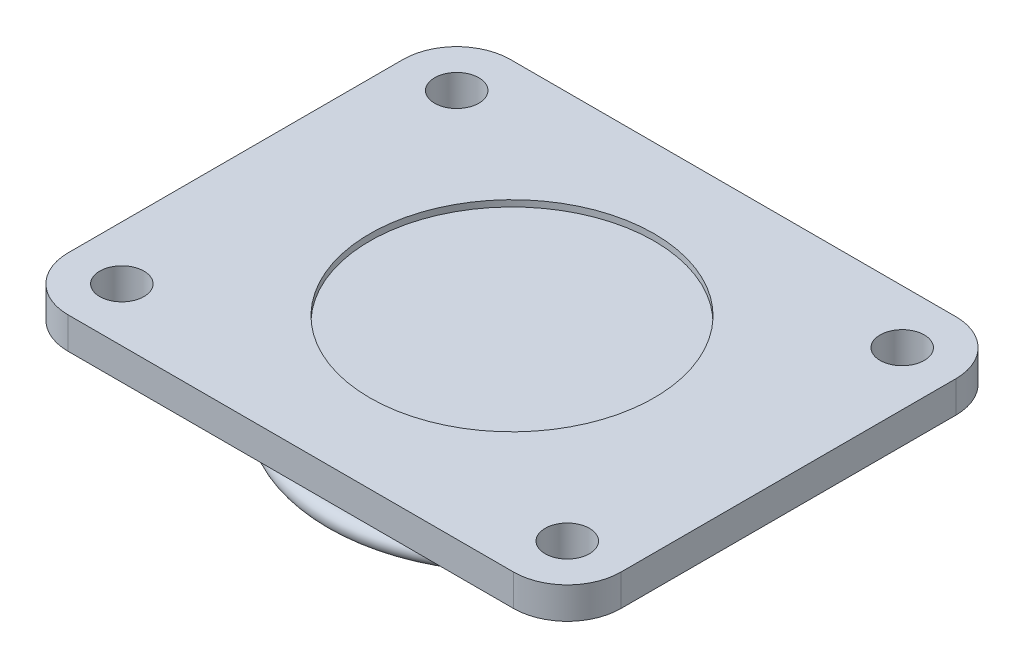
ISO-10303-21;
HEADER;
FILE_DESCRIPTION(('STEP AP214'),'2;1');
FILE_NAME('part.step','',(''),(''),'','','');
FILE_SCHEMA(('AUTOMOTIVE_DESIGN { 1 0 10303 214 1 1 1 1 }'));
ENDSEC;
DATA;
#1=APPLICATION_CONTEXT('core data for automotive mechanical design processes');
#2=APPLICATION_PROTOCOL_DEFINITION('international standard','automotive_design',2000,#1);
#3=PRODUCT_CONTEXT('',#1,'mechanical');
#4=PRODUCT('Part','Part','',(#3));
#5=PRODUCT_RELATED_PRODUCT_CATEGORY('part','',(#4));
#6=PRODUCT_DEFINITION_FORMATION('','',#4);
#7=PRODUCT_DEFINITION_CONTEXT('part definition',#1,'design');
#8=PRODUCT_DEFINITION('design','',#6,#7);
#9=PRODUCT_DEFINITION_SHAPE('','',#8);
#10=(LENGTH_UNIT() NAMED_UNIT(*) SI_UNIT(.MILLI.,.METRE.));
#11=(NAMED_UNIT(*) PLANE_ANGLE_UNIT() SI_UNIT($,.RADIAN.));
#12=(NAMED_UNIT(*) SI_UNIT($,.STERADIAN.) SOLID_ANGLE_UNIT());
#13=UNCERTAINTY_MEASURE_WITH_UNIT(LENGTH_MEASURE(1.E-05),#10,'distance_accuracy_value','');
#14=(GEOMETRIC_REPRESENTATION_CONTEXT(3) GLOBAL_UNCERTAINTY_ASSIGNED_CONTEXT((#13)) GLOBAL_UNIT_ASSIGNED_CONTEXT((#10,
#11,#12)) REPRESENTATION_CONTEXT('',''));
#15=CARTESIAN_POINT('',(0.,0.,0.));
#16=DIRECTION('',(0.,0.,1.));
#17=DIRECTION('',(1.,0.,0.));
#18=AXIS2_PLACEMENT_3D('',#15,#16,#17);
#19=CARTESIAN_POINT('',(70.5,10.,-53.));
#20=DIRECTION('',(0.,-1.,0.));
#21=DIRECTION('',(0.,0.,-1.));
#22=AXIS2_PLACEMENT_3D('',#19,#20,#21);
#23=PLANE('',#22);
#24=CARTESIAN_POINT('',(0.,10.,0.));
#25=DIRECTION('',(0.,1.,0.));
#26=DIRECTION('',(0.,0.,1.));
#27=AXIS2_PLACEMENT_3D('',#24,#25,#26);
#28=CIRCLE('',#27,45.);
#29=CARTESIAN_POINT('',(0.,10.,45.));
#30=VERTEX_POINT('',#29);
#31=EDGE_CURVE('E286',#30,#30,#28,.T.);
#32=ORIENTED_EDGE('',*,*,#31,.F.);
#33=EDGE_LOOP('',(#32));
#34=FACE_BOUND('',#33,.T.);
#35=CARTESIAN_POINT('',(70.5,10.,-53.));
#36=DIRECTION('',(0.,1.,0.));
#37=DIRECTION('',(0.,0.,-1.));
#38=AXIS2_PLACEMENT_3D('',#35,#36,#37);
#39=CIRCLE('',#38,17.);
#40=CARTESIAN_POINT('',(87.5,10.,-52.9999999999999));
#41=VERTEX_POINT('',#40);
#42=CARTESIAN_POINT('',(70.4999999999999,10.,-70.));
#43=VERTEX_POINT('',#42);
#44=EDGE_CURVE('E148',#41,#43,#39,.T.);
#45=ORIENTED_EDGE('',*,*,#44,.T.);
#46=DIRECTION('',(-1.,0.,0.));
#47=VECTOR('',#46,1.);
#48=CARTESIAN_POINT('',(-70.4999999999998,10.,-70.));
#49=LINE('',#48,#47);
#50=CARTESIAN_POINT('',(-70.4999999999998,10.,-70.));
#51=VERTEX_POINT('',#50);
#52=EDGE_CURVE('E96',#43,#51,#49,.T.);
#53=ORIENTED_EDGE('',*,*,#52,.T.);
#54=CARTESIAN_POINT('',(-70.5,10.,-53.));
#55=DIRECTION('',(0.,1.,0.));
#56=DIRECTION('',(0.,0.,1.));
#57=AXIS2_PLACEMENT_3D('',#54,#55,#56);
#58=CIRCLE('',#57,17.);
#59=CARTESIAN_POINT('',(-87.5,10.,-52.9999999999999));
#60=VERTEX_POINT('',#59);
#61=EDGE_CURVE('E199',#51,#60,#58,.T.);
#62=ORIENTED_EDGE('',*,*,#61,.T.);
#63=DIRECTION('',(0.,0.,1.));
#64=VECTOR('',#63,1.);
#65=CARTESIAN_POINT('',(-87.5,10.,-52.9999999999999));
#66=LINE('',#65,#64);
#67=CARTESIAN_POINT('',(-87.5,10.,52.9999999999999));
#68=VERTEX_POINT('',#67);
#69=EDGE_CURVE('E201',#60,#68,#66,.T.);
#70=ORIENTED_EDGE('',*,*,#69,.T.);
#71=CARTESIAN_POINT('',(-70.5,10.,53.));
#72=DIRECTION('',(0.,1.,0.));
#73=DIRECTION('',(0.,0.,1.));
#74=AXIS2_PLACEMENT_3D('',#71,#72,#73);
#75=CIRCLE('',#74,17.);
#76=CARTESIAN_POINT('',(-70.5,10.,70.));
#77=VERTEX_POINT('',#76);
#78=EDGE_CURVE('E115',#68,#77,#75,.T.);
#79=ORIENTED_EDGE('',*,*,#78,.T.);
#80=DIRECTION('',(1.,0.,0.));
#81=VECTOR('',#80,1.);
#82=CARTESIAN_POINT('',(-70.4999999999998,10.,70.));
#83=LINE('',#82,#81);
#84=CARTESIAN_POINT('',(70.4999999999999,10.,70.));
#85=VERTEX_POINT('',#84);
#86=EDGE_CURVE('E109',#77,#85,#83,.T.);
#87=ORIENTED_EDGE('',*,*,#86,.T.);
#88=CARTESIAN_POINT('',(70.5,10.,53.));
#89=DIRECTION('',(0.,1.,0.));
#90=DIRECTION('',(0.,0.,1.));
#91=AXIS2_PLACEMENT_3D('',#88,#89,#90);
#92=CIRCLE('',#91,17.);
#93=CARTESIAN_POINT('',(87.5,10.,52.9999999999999));
#94=VERTEX_POINT('',#93);
#95=EDGE_CURVE('E113',#85,#94,#92,.T.);
#96=ORIENTED_EDGE('',*,*,#95,.T.);
#97=DIRECTION('',(0.,0.,-1.));
#98=VECTOR('',#97,1.);
#99=CARTESIAN_POINT('',(87.5,10.,-52.9999999999999));
#100=LINE('',#99,#98);
#101=EDGE_CURVE('E52',#94,#41,#100,.T.);
#102=ORIENTED_EDGE('',*,*,#101,.T.);
#103=EDGE_LOOP('',(#45,#53,#62,#70,#79,#87,#96,#102));
#104=FACE_BOUND('',#103,.T.);
#105=CARTESIAN_POINT('',(-70.5,10.,-53.));
#106=DIRECTION('',(0.,1.,0.));
#107=DIRECTION('',(0.,0.,1.));
#108=AXIS2_PLACEMENT_3D('',#105,#106,#107);
#109=CIRCLE('',#108,7.);
#110=CARTESIAN_POINT('',(-70.5,10.,-46.));
#111=VERTEX_POINT('',#110);
#112=EDGE_CURVE('E137',#111,#111,#109,.T.);
#113=ORIENTED_EDGE('',*,*,#112,.F.);
#114=EDGE_LOOP('',(#113));
#115=FACE_BOUND('',#114,.T.);
#116=CARTESIAN_POINT('',(70.5,10.,-53.));
#117=DIRECTION('',(0.,1.,0.));
#118=DIRECTION('',(0.,0.,1.));
#119=AXIS2_PLACEMENT_3D('',#116,#117,#118);
#120=CIRCLE('',#119,7.);
#121=CARTESIAN_POINT('',(70.5,10.,-46.));
#122=VERTEX_POINT('',#121);
#123=EDGE_CURVE('E187',#122,#122,#120,.T.);
#124=ORIENTED_EDGE('',*,*,#123,.F.);
#125=EDGE_LOOP('',(#124));
#126=FACE_BOUND('',#125,.T.);
#127=CARTESIAN_POINT('',(70.5,10.,53.));
#128=DIRECTION('',(0.,1.,0.));
#129=DIRECTION('',(0.,0.,1.));
#130=AXIS2_PLACEMENT_3D('',#127,#128,#129);
#131=CIRCLE('',#130,7.);
#132=CARTESIAN_POINT('',(70.5,10.,60.));
#133=VERTEX_POINT('',#132);
#134=EDGE_CURVE('E181',#133,#133,#131,.T.);
#135=ORIENTED_EDGE('',*,*,#134,.F.);
#136=EDGE_LOOP('',(#135));
#137=FACE_BOUND('',#136,.T.);
#138=CARTESIAN_POINT('',(-70.5,10.,53.));
#139=DIRECTION('',(0.,1.,0.));
#140=DIRECTION('',(0.,0.,1.));
#141=AXIS2_PLACEMENT_3D('',#138,#139,#140);
#142=CIRCLE('',#141,7.);
#143=CARTESIAN_POINT('',(-70.5,10.,60.));
#144=VERTEX_POINT('',#143);
#145=EDGE_CURVE('E174',#144,#144,#142,.T.);
#146=ORIENTED_EDGE('',*,*,#145,.F.);
#147=EDGE_LOOP('',(#146));
#148=FACE_BOUND('',#147,.T.);
#149=ADVANCED_FACE('F35',(#34,#104,#115,#126,#137,#148),#23,.F.);
#150=CARTESIAN_POINT('',(70.5,0.,-53.));
#151=DIRECTION('',(0.,-1.,0.));
#152=DIRECTION('',(0.,0.,-1.));
#153=AXIS2_PLACEMENT_3D('',#150,#151,#152);
#154=PLANE('',#153);
#155=CARTESIAN_POINT('',(0.,0.,0.));
#156=DIRECTION('',(0.,-1.,0.));
#157=DIRECTION('',(0.,0.,-1.));
#158=AXIS2_PLACEMENT_3D('',#155,#156,#157);
#159=CIRCLE('',#158,56.);
#160=CARTESIAN_POINT('',(0.,0.,-56.));
#161=VERTEX_POINT('',#160);
#162=EDGE_CURVE('E162',#161,#161,#159,.T.);
#163=ORIENTED_EDGE('',*,*,#162,.F.);
#164=EDGE_LOOP('',(#163));
#165=FACE_BOUND('',#164,.T.);
#166=CARTESIAN_POINT('',(70.5,0.,53.));
#167=DIRECTION('',(0.,1.,0.));
#168=DIRECTION('',(0.,0.,1.));
#169=AXIS2_PLACEMENT_3D('',#166,#167,#168);
#170=CIRCLE('',#169,7.);
#171=CARTESIAN_POINT('',(70.5,0.,60.));
#172=VERTEX_POINT('',#171);
#173=EDGE_CURVE('E177',#172,#172,#170,.T.);
#174=ORIENTED_EDGE('',*,*,#173,.T.);
#175=EDGE_LOOP('',(#174));
#176=FACE_BOUND('',#175,.T.);
#177=CARTESIAN_POINT('',(-70.5,0.,-53.));
#178=DIRECTION('',(0.,1.,0.));
#179=DIRECTION('',(0.,0.,1.));
#180=AXIS2_PLACEMENT_3D('',#177,#178,#179);
#181=CIRCLE('',#180,7.);
#182=CARTESIAN_POINT('',(-70.5,0.,-46.));
#183=VERTEX_POINT('',#182);
#184=EDGE_CURVE('E190',#183,#183,#181,.T.);
#185=ORIENTED_EDGE('',*,*,#184,.T.);
#186=EDGE_LOOP('',(#185));
#187=FACE_BOUND('',#186,.T.);
#188=CARTESIAN_POINT('',(70.5,0.,-53.));
#189=DIRECTION('',(0.,1.,0.));
#190=DIRECTION('',(0.,0.,-1.));
#191=AXIS2_PLACEMENT_3D('',#188,#189,#190);
#192=CIRCLE('',#191,17.);
#193=CARTESIAN_POINT('',(87.5,0.,-52.9999999999999));
#194=VERTEX_POINT('',#193);
#195=CARTESIAN_POINT('',(70.4999999999999,0.,-70.));
#196=VERTEX_POINT('',#195);
#197=EDGE_CURVE('E133',#194,#196,#192,.T.);
#198=ORIENTED_EDGE('',*,*,#197,.F.);
#199=DIRECTION('',(0.,0.,-1.));
#200=VECTOR('',#199,1.);
#201=CARTESIAN_POINT('',(87.5,0.,-52.9999999999999));
#202=LINE('',#201,#200);
#203=CARTESIAN_POINT('',(87.5,0.,52.9999999999999));
#204=VERTEX_POINT('',#203);
#205=EDGE_CURVE('E87',#204,#194,#202,.T.);
#206=ORIENTED_EDGE('',*,*,#205,.F.);
#207=CARTESIAN_POINT('',(70.5,0.,53.));
#208=DIRECTION('',(0.,1.,0.));
#209=DIRECTION('',(0.,0.,1.));
#210=AXIS2_PLACEMENT_3D('',#207,#208,#209);
#211=CIRCLE('',#210,17.);
#212=CARTESIAN_POINT('',(70.4999999999999,0.,70.));
#213=VERTEX_POINT('',#212);
#214=EDGE_CURVE('E81',#213,#204,#211,.T.);
#215=ORIENTED_EDGE('',*,*,#214,.F.);
#216=DIRECTION('',(1.,0.,0.));
#217=VECTOR('',#216,1.);
#218=CARTESIAN_POINT('',(-70.4999999999998,0.,70.));
#219=LINE('',#218,#217);
#220=CARTESIAN_POINT('',(-70.5,0.,70.));
#221=VERTEX_POINT('',#220);
#222=EDGE_CURVE('E123',#221,#213,#219,.T.);
#223=ORIENTED_EDGE('',*,*,#222,.F.);
#224=CARTESIAN_POINT('',(-70.5,0.,53.));
#225=DIRECTION('',(0.,1.,0.));
#226=DIRECTION('',(0.,0.,1.));
#227=AXIS2_PLACEMENT_3D('',#224,#225,#226);
#228=CIRCLE('',#227,17.);
#229=CARTESIAN_POINT('',(-87.5,0.,52.9999999999999));
#230=VERTEX_POINT('',#229);
#231=EDGE_CURVE('E143',#230,#221,#228,.T.);
#232=ORIENTED_EDGE('',*,*,#231,.F.);
#233=DIRECTION('',(0.,0.,1.));
#234=VECTOR('',#233,1.);
#235=CARTESIAN_POINT('',(-87.5,0.,-52.9999999999999));
#236=LINE('',#235,#234);
#237=CARTESIAN_POINT('',(-87.5,0.,-52.9999999999999));
#238=VERTEX_POINT('',#237);
#239=EDGE_CURVE('E141',#238,#230,#236,.T.);
#240=ORIENTED_EDGE('',*,*,#239,.F.);
#241=CARTESIAN_POINT('',(-70.5,0.,-53.));
#242=DIRECTION('',(0.,1.,0.));
#243=DIRECTION('',(0.,0.,1.));
#244=AXIS2_PLACEMENT_3D('',#241,#242,#243);
#245=CIRCLE('',#244,17.);
#246=CARTESIAN_POINT('',(-70.4999999999998,0.,-70.));
#247=VERTEX_POINT('',#246);
#248=EDGE_CURVE('E139',#247,#238,#245,.T.);
#249=ORIENTED_EDGE('',*,*,#248,.F.);
#250=DIRECTION('',(-1.,0.,0.));
#251=VECTOR('',#250,1.);
#252=CARTESIAN_POINT('',(-70.4999999999998,0.,-70.));
#253=LINE('',#252,#251);
#254=EDGE_CURVE('E136',#196,#247,#253,.T.);
#255=ORIENTED_EDGE('',*,*,#254,.F.);
#256=EDGE_LOOP('',(#198,#206,#215,#223,#232,#240,#249,#255));
#257=FACE_BOUND('',#256,.T.);
#258=CARTESIAN_POINT('',(70.5,0.,-53.));
#259=DIRECTION('',(0.,1.,0.));
#260=DIRECTION('',(0.,0.,1.));
#261=AXIS2_PLACEMENT_3D('',#258,#259,#260);
#262=CIRCLE('',#261,7.);
#263=CARTESIAN_POINT('',(70.5,0.,-46.));
#264=VERTEX_POINT('',#263);
#265=EDGE_CURVE('E184',#264,#264,#262,.T.);
#266=ORIENTED_EDGE('',*,*,#265,.T.);
#267=EDGE_LOOP('',(#266));
#268=FACE_BOUND('',#267,.T.);
#269=CARTESIAN_POINT('',(-70.5,0.,53.));
#270=DIRECTION('',(0.,1.,0.));
#271=DIRECTION('',(0.,0.,1.));
#272=AXIS2_PLACEMENT_3D('',#269,#270,#271);
#273=CIRCLE('',#272,7.);
#274=CARTESIAN_POINT('',(-70.5,0.,60.));
#275=VERTEX_POINT('',#274);
#276=EDGE_CURVE('E178',#275,#275,#273,.T.);
#277=ORIENTED_EDGE('',*,*,#276,.T.);
#278=EDGE_LOOP('',(#277));
#279=FACE_BOUND('',#278,.T.);
#280=ADVANCED_FACE('F214',(#165,#176,#187,#257,#268,#279),#154,.T.);
#281=CARTESIAN_POINT('',(70.5,10.,-53.));
#282=DIRECTION('',(0.,-1.,0.));
#283=DIRECTION('',(0.,0.,-1.));
#284=AXIS2_PLACEMENT_3D('',#281,#282,#283);
#285=CYLINDRICAL_SURFACE('',#284,17.);
#286=ORIENTED_EDGE('',*,*,#197,.T.);
#287=DIRECTION('',(0.,-1.,0.));
#288=VECTOR('',#287,1.);
#289=CARTESIAN_POINT('',(70.4999999999999,10.,-70.));
#290=LINE('',#289,#288);
#291=EDGE_CURVE('E161',#43,#196,#290,.T.);
#292=ORIENTED_EDGE('',*,*,#291,.F.);
#293=ORIENTED_EDGE('',*,*,#44,.F.);
#294=DIRECTION('',(0.,-1.,0.));
#295=VECTOR('',#294,1.);
#296=CARTESIAN_POINT('',(87.5,10.,-52.9999999999999));
#297=LINE('',#296,#295);
#298=EDGE_CURVE('E129',#41,#194,#297,.T.);
#299=ORIENTED_EDGE('',*,*,#298,.T.);
#300=EDGE_LOOP('',(#286,#292,#293,#299));
#301=FACE_BOUND('',#300,.T.);
#302=ADVANCED_FACE('F219',(#301),#285,.T.);
#303=CARTESIAN_POINT('',(-70.4999999999998,10.,-70.));
#304=DIRECTION('',(0.,0.,1.));
#305=DIRECTION('',(1.,0.,0.));
#306=AXIS2_PLACEMENT_3D('',#303,#304,#305);
#307=PLANE('',#306);
#308=ORIENTED_EDGE('',*,*,#254,.T.);
#309=DIRECTION('',(0.,-1.,0.));
#310=VECTOR('',#309,1.);
#311=CARTESIAN_POINT('',(-70.4999999999998,10.,-70.));
#312=LINE('',#311,#310);
#313=EDGE_CURVE('E158',#51,#247,#312,.T.);
#314=ORIENTED_EDGE('',*,*,#313,.F.);
#315=ORIENTED_EDGE('',*,*,#52,.F.);
#316=ORIENTED_EDGE('',*,*,#291,.T.);
#317=EDGE_LOOP('',(#308,#314,#315,#316));
#318=FACE_BOUND('',#317,.T.);
#319=ADVANCED_FACE('F393',(#318),#307,.F.);
#320=CARTESIAN_POINT('',(-70.5,10.,-53.));
#321=DIRECTION('',(0.,-1.,0.));
#322=DIRECTION('',(0.,0.,-1.));
#323=AXIS2_PLACEMENT_3D('',#320,#321,#322);
#324=CYLINDRICAL_SURFACE('',#323,17.);
#325=ORIENTED_EDGE('',*,*,#248,.T.);
#326=DIRECTION('',(0.,-1.,0.));
#327=VECTOR('',#326,1.);
#328=CARTESIAN_POINT('',(-87.5,10.,-52.9999999999999));
#329=LINE('',#328,#327);
#330=EDGE_CURVE('E155',#60,#238,#329,.T.);
#331=ORIENTED_EDGE('',*,*,#330,.F.);
#332=ORIENTED_EDGE('',*,*,#61,.F.);
#333=ORIENTED_EDGE('',*,*,#313,.T.);
#334=EDGE_LOOP('',(#325,#331,#332,#333));
#335=FACE_BOUND('',#334,.T.);
#336=ADVANCED_FACE('F384',(#335),#324,.T.);
#337=CARTESIAN_POINT('',(-87.5,10.,-52.9999999999999));
#338=DIRECTION('',(1.,0.,0.));
#339=DIRECTION('',(0.,0.,-1.));
#340=AXIS2_PLACEMENT_3D('',#337,#338,#339);
#341=PLANE('',#340);
#342=ORIENTED_EDGE('',*,*,#239,.T.);
#343=DIRECTION('',(0.,-1.,0.));
#344=VECTOR('',#343,1.);
#345=CARTESIAN_POINT('',(-87.5,10.,52.9999999999999));
#346=LINE('',#345,#344);
#347=EDGE_CURVE('E152',#68,#230,#346,.T.);
#348=ORIENTED_EDGE('',*,*,#347,.F.);
#349=ORIENTED_EDGE('',*,*,#69,.F.);
#350=ORIENTED_EDGE('',*,*,#330,.T.);
#351=EDGE_LOOP('',(#342,#348,#349,#350));
#352=FACE_BOUND('',#351,.T.);
#353=ADVANCED_FACE('F207',(#352),#341,.F.);
#354=CARTESIAN_POINT('',(-70.5,10.,53.));
#355=DIRECTION('',(0.,-1.,0.));
#356=DIRECTION('',(0.,0.,-1.));
#357=AXIS2_PLACEMENT_3D('',#354,#355,#356);
#358=CYLINDRICAL_SURFACE('',#357,17.);
#359=ORIENTED_EDGE('',*,*,#231,.T.);
#360=DIRECTION('',(0.,-1.,0.));
#361=VECTOR('',#360,1.);
#362=CARTESIAN_POINT('',(-70.5,10.,70.));
#363=LINE('',#362,#361);
#364=EDGE_CURVE('E124',#77,#221,#363,.T.);
#365=ORIENTED_EDGE('',*,*,#364,.F.);
#366=ORIENTED_EDGE('',*,*,#78,.F.);
#367=ORIENTED_EDGE('',*,*,#347,.T.);
#368=EDGE_LOOP('',(#359,#365,#366,#367));
#369=FACE_BOUND('',#368,.T.);
#370=ADVANCED_FACE('F211',(#369),#358,.T.);
#371=CARTESIAN_POINT('',(-70.4999999999998,10.,70.));
#372=DIRECTION('',(0.,0.,-1.));
#373=DIRECTION('',(-1.,0.,0.));
#374=AXIS2_PLACEMENT_3D('',#371,#372,#373);
#375=PLANE('',#374);
#376=ORIENTED_EDGE('',*,*,#222,.T.);
#377=DIRECTION('',(0.,-1.,0.));
#378=VECTOR('',#377,1.);
#379=CARTESIAN_POINT('',(70.4999999999999,10.,70.));
#380=LINE('',#379,#378);
#381=EDGE_CURVE('E120',#85,#213,#380,.T.);
#382=ORIENTED_EDGE('',*,*,#381,.F.);
#383=ORIENTED_EDGE('',*,*,#86,.F.);
#384=ORIENTED_EDGE('',*,*,#364,.T.);
#385=EDGE_LOOP('',(#376,#382,#383,#384));
#386=FACE_BOUND('',#385,.T.);
#387=ADVANCED_FACE('F121',(#386),#375,.F.);
#388=CARTESIAN_POINT('',(70.5,10.,53.));
#389=DIRECTION('',(0.,-1.,0.));
#390=DIRECTION('',(0.,0.,-1.));
#391=AXIS2_PLACEMENT_3D('',#388,#389,#390);
#392=CYLINDRICAL_SURFACE('',#391,17.);
#393=ORIENTED_EDGE('',*,*,#214,.T.);
#394=DIRECTION('',(0.,-1.,0.));
#395=VECTOR('',#394,1.);
#396=CARTESIAN_POINT('',(87.5,10.,52.9999999999999));
#397=LINE('',#396,#395);
#398=EDGE_CURVE('E125',#94,#204,#397,.T.);
#399=ORIENTED_EDGE('',*,*,#398,.F.);
#400=ORIENTED_EDGE('',*,*,#95,.F.);
#401=ORIENTED_EDGE('',*,*,#381,.T.);
#402=EDGE_LOOP('',(#393,#399,#400,#401));
#403=FACE_BOUND('',#402,.T.);
#404=ADVANCED_FACE('F127',(#403),#392,.T.);
#405=CARTESIAN_POINT('',(87.5,10.,-52.9999999999999));
#406=DIRECTION('',(-1.,0.,0.));
#407=DIRECTION('',(0.,0.,1.));
#408=AXIS2_PLACEMENT_3D('',#405,#406,#407);
#409=PLANE('',#408);
#410=ORIENTED_EDGE('',*,*,#205,.T.);
#411=ORIENTED_EDGE('',*,*,#298,.F.);
#412=ORIENTED_EDGE('',*,*,#101,.F.);
#413=ORIENTED_EDGE('',*,*,#398,.T.);
#414=EDGE_LOOP('',(#410,#411,#412,#413));
#415=FACE_BOUND('',#414,.T.);
#416=ADVANCED_FACE('F221',(#415),#409,.F.);
#417=CARTESIAN_POINT('',(-70.5,10.,-53.));
#418=DIRECTION('',(0.,-1.,0.));
#419=DIRECTION('',(0.,0.,-1.));
#420=AXIS2_PLACEMENT_3D('',#417,#418,#419);
#421=CYLINDRICAL_SURFACE('',#420,7.);
#422=ORIENTED_EDGE('',*,*,#112,.T.);
#423=EDGE_LOOP('',(#422));
#424=FACE_BOUND('',#423,.T.);
#425=ORIENTED_EDGE('',*,*,#184,.F.);
#426=EDGE_LOOP('',(#425));
#427=FACE_BOUND('',#426,.T.);
#428=ADVANCED_FACE('F223',(#424,#427),#421,.F.);
#429=CARTESIAN_POINT('',(70.5,10.,-53.));
#430=DIRECTION('',(0.,-1.,0.));
#431=DIRECTION('',(0.,0.,-1.));
#432=AXIS2_PLACEMENT_3D('',#429,#430,#431);
#433=CYLINDRICAL_SURFACE('',#432,7.);
#434=ORIENTED_EDGE('',*,*,#123,.T.);
#435=EDGE_LOOP('',(#434));
#436=FACE_BOUND('',#435,.T.);
#437=ORIENTED_EDGE('',*,*,#265,.F.);
#438=EDGE_LOOP('',(#437));
#439=FACE_BOUND('',#438,.T.);
#440=ADVANCED_FACE('F229',(#436,#439),#433,.F.);
#441=CARTESIAN_POINT('',(70.5,10.,53.));
#442=DIRECTION('',(0.,-1.,0.));
#443=DIRECTION('',(0.,0.,-1.));
#444=AXIS2_PLACEMENT_3D('',#441,#442,#443);
#445=CYLINDRICAL_SURFACE('',#444,7.);
#446=ORIENTED_EDGE('',*,*,#134,.T.);
#447=EDGE_LOOP('',(#446));
#448=FACE_BOUND('',#447,.T.);
#449=ORIENTED_EDGE('',*,*,#173,.F.);
#450=EDGE_LOOP('',(#449));
#451=FACE_BOUND('',#450,.T.);
#452=ADVANCED_FACE('F245',(#448,#451),#445,.F.);
#453=CARTESIAN_POINT('',(-70.5,10.,53.));
#454=DIRECTION('',(0.,-1.,0.));
#455=DIRECTION('',(0.,0.,-1.));
#456=AXIS2_PLACEMENT_3D('',#453,#454,#455);
#457=CYLINDRICAL_SURFACE('',#456,7.);
#458=ORIENTED_EDGE('',*,*,#145,.T.);
#459=EDGE_LOOP('',(#458));
#460=FACE_BOUND('',#459,.T.);
#461=ORIENTED_EDGE('',*,*,#276,.F.);
#462=EDGE_LOOP('',(#461));
#463=FACE_BOUND('',#462,.T.);
#464=ADVANCED_FACE('F249',(#460,#463),#457,.F.);
#465=CARTESIAN_POINT('',(0.,-20.,0.));
#466=DIRECTION('',(0.,1.,0.));
#467=DIRECTION('',(0.,0.,1.));
#468=AXIS2_PLACEMENT_3D('',#465,#466,#467);
#469=CYLINDRICAL_SURFACE('',#468,56.);
#470=CARTESIAN_POINT('',(0.,-14.,0.));
#471=DIRECTION('',(0.,-1.,0.));
#472=DIRECTION('',(0.,0.,-1.));
#473=AXIS2_PLACEMENT_3D('',#470,#471,#472);
#474=CIRCLE('',#473,56.);
#475=CARTESIAN_POINT('',(0.,-14.,-56.));
#476=VERTEX_POINT('',#475);
#477=EDGE_CURVE('E172',#476,#476,#474,.F.);
#478=ORIENTED_EDGE('',*,*,#477,.T.);
#479=EDGE_LOOP('',(#478));
#480=FACE_BOUND('',#479,.T.);
#481=ORIENTED_EDGE('',*,*,#162,.T.);
#482=EDGE_LOOP('',(#481));
#483=FACE_BOUND('',#482,.T.);
#484=ADVANCED_FACE('F253',(#480,#483),#469,.T.);
#485=CARTESIAN_POINT('',(0.,-17.,0.));
#486=DIRECTION('',(0.,1.,0.));
#487=DIRECTION('',(0.,0.,1.));
#488=AXIS2_PLACEMENT_3D('',#485,#486,#487);
#489=TOROIDAL_SURFACE('',#488,56.,3.);
#490=CARTESIAN_POINT('',(0.,-20.,0.));
#491=DIRECTION('',(0.,1.,0.));
#492=DIRECTION('',(0.,0.,1.));
#493=AXIS2_PLACEMENT_3D('',#490,#491,#492);
#494=CIRCLE('',#493,56.);
#495=CARTESIAN_POINT('',(0.,-20.,56.));
#496=VERTEX_POINT('',#495);
#497=EDGE_CURVE('E289',#496,#496,#494,.T.);
#498=ORIENTED_EDGE('',*,*,#497,.T.);
#499=EDGE_LOOP('',(#498));
#500=FACE_BOUND('',#499,.T.);
#501=ORIENTED_EDGE('',*,*,#477,.F.);
#502=EDGE_LOOP('',(#501));
#503=FACE_BOUND('',#502,.T.);
#504=ADVANCED_FACE('F257',(#500,#503),#489,.T.);
#505=CARTESIAN_POINT('',(0.,-20.,0.));
#506=DIRECTION('',(0.,-1.,0.));
#507=DIRECTION('',(0.,0.,-1.));
#508=AXIS2_PLACEMENT_3D('',#505,#506,#507);
#509=PLANE('',#508);
#510=CARTESIAN_POINT('',(0.,-20.,0.));
#511=DIRECTION('',(0.,-1.,0.));
#512=DIRECTION('',(0.,0.,-1.));
#513=AXIS2_PLACEMENT_3D('',#510,#511,#512);
#514=CIRCLE('',#513,7.5);
#515=CARTESIAN_POINT('',(0.,-20.,-7.5));
#516=VERTEX_POINT('',#515);
#517=EDGE_CURVE('E285',#516,#516,#514,.T.);
#518=ORIENTED_EDGE('',*,*,#517,.F.);
#519=EDGE_LOOP('',(#518));
#520=FACE_BOUND('',#519,.T.);
#521=ORIENTED_EDGE('',*,*,#497,.F.);
#522=EDGE_LOOP('',(#521));
#523=FACE_BOUND('',#522,.T.);
#524=ADVANCED_FACE('F259',(#520,#523),#509,.T.);
#525=CARTESIAN_POINT('',(0.,-45.,0.));
#526=DIRECTION('',(0.,1.,0.));
#527=DIRECTION('',(0.,0.,1.));
#528=AXIS2_PLACEMENT_3D('',#525,#526,#527);
#529=CYLINDRICAL_SURFACE('',#528,7.5);
#530=CARTESIAN_POINT('',(0.,-44.,0.));
#531=DIRECTION('',(0.,-1.,0.));
#532=DIRECTION('',(0.,0.,-1.));
#533=AXIS2_PLACEMENT_3D('',#530,#531,#532);
#534=CIRCLE('',#533,7.5);
#535=CARTESIAN_POINT('',(0.,-44.,-7.5));
#536=VERTEX_POINT('',#535);
#537=EDGE_CURVE('E11',#536,#536,#534,.F.);
#538=ORIENTED_EDGE('',*,*,#537,.T.);
#539=EDGE_LOOP('',(#538));
#540=FACE_BOUND('',#539,.T.);
#541=ORIENTED_EDGE('',*,*,#517,.T.);
#542=EDGE_LOOP('',(#541));
#543=FACE_BOUND('',#542,.T.);
#544=ADVANCED_FACE('F262',(#540,#543),#529,.T.);
#545=CARTESIAN_POINT('',(0.,-45.,0.));
#546=DIRECTION('',(0.,-1.,0.));
#547=DIRECTION('',(0.,0.,-1.));
#548=AXIS2_PLACEMENT_3D('',#545,#546,#547);
#549=PLANE('',#548);
#550=CARTESIAN_POINT('',(0.,-45.,0.));
#551=DIRECTION('',(0.,-1.,0.));
#552=DIRECTION('',(0.,0.,-1.));
#553=AXIS2_PLACEMENT_3D('',#550,#551,#552);
#554=CIRCLE('',#553,6.50000000000001);
#555=CARTESIAN_POINT('',(0.,-45.,-6.50000000000001));
#556=VERTEX_POINT('',#555);
#557=EDGE_CURVE('E44',#556,#556,#554,.T.);
#558=ORIENTED_EDGE('',*,*,#557,.T.);
#559=EDGE_LOOP('',(#558));
#560=FACE_BOUND('',#559,.T.);
#561=ADVANCED_FACE('F269',(#560),#549,.T.);
#562=CARTESIAN_POINT('',(0.,-45.,0.));
#563=DIRECTION('',(0.,1.,0.));
#564=DIRECTION('',(0.,0.,1.));
#565=AXIS2_PLACEMENT_3D('',#562,#563,#564);
#566=CONICAL_SURFACE('',#565,6.50000000000001,0.785398163397435);
#567=ORIENTED_EDGE('',*,*,#537,.F.);
#568=EDGE_LOOP('',(#567));
#569=FACE_BOUND('',#568,.T.);
#570=ORIENTED_EDGE('',*,*,#557,.F.);
#571=EDGE_LOOP('',(#570));
#572=FACE_BOUND('',#571,.T.);
#573=ADVANCED_FACE('F37',(#569,#572),#566,.T.);
#574=CARTESIAN_POINT('',(0.,8.,0.));
#575=DIRECTION('',(0.,1.,0.));
#576=DIRECTION('',(0.,0.,1.));
#577=AXIS2_PLACEMENT_3D('',#574,#575,#576);
#578=CYLINDRICAL_SURFACE('',#577,45.);
#579=CARTESIAN_POINT('',(0.,8.,0.));
#580=DIRECTION('',(0.,1.,0.));
#581=DIRECTION('',(0.,0.,1.));
#582=AXIS2_PLACEMENT_3D('',#579,#580,#581);
#583=CIRCLE('',#582,45.);
#584=CARTESIAN_POINT('',(0.,8.,45.));
#585=VERTEX_POINT('',#584);
#586=EDGE_CURVE('E284',#585,#585,#583,.T.);
#587=ORIENTED_EDGE('',*,*,#586,.F.);
#588=EDGE_LOOP('',(#587));
#589=FACE_BOUND('',#588,.T.);
#590=ORIENTED_EDGE('',*,*,#31,.T.);
#591=EDGE_LOOP('',(#590));
#592=FACE_BOUND('',#591,.T.);
#593=ADVANCED_FACE('F273',(#589,#592),#578,.F.);
#594=CARTESIAN_POINT('',(0.,8.,0.));
#595=DIRECTION('',(0.,1.,0.));
#596=DIRECTION('',(0.,0.,1.));
#597=AXIS2_PLACEMENT_3D('',#594,#595,#596);
#598=PLANE('',#597);
#599=ORIENTED_EDGE('',*,*,#586,.T.);
#600=EDGE_LOOP('',(#599));
#601=FACE_BOUND('',#600,.T.);
#602=ADVANCED_FACE('F276',(#601),#598,.T.);
#603=CLOSED_SHELL('',(#149,#280,#302,#319,#336,#353,#370,#387,#404,#416,#428,#440,#452,#464,
#484,#504,#524,#544,#561,#573,#593,#602));
#604=MANIFOLD_SOLID_BREP('B2',#603);
#605=ADVANCED_BREP_SHAPE_REPRESENTATION('',(#18,#604),#14);
#606=SHAPE_DEFINITION_REPRESENTATION(#9,#605);
ENDSEC;
END-ISO-10303-21;
